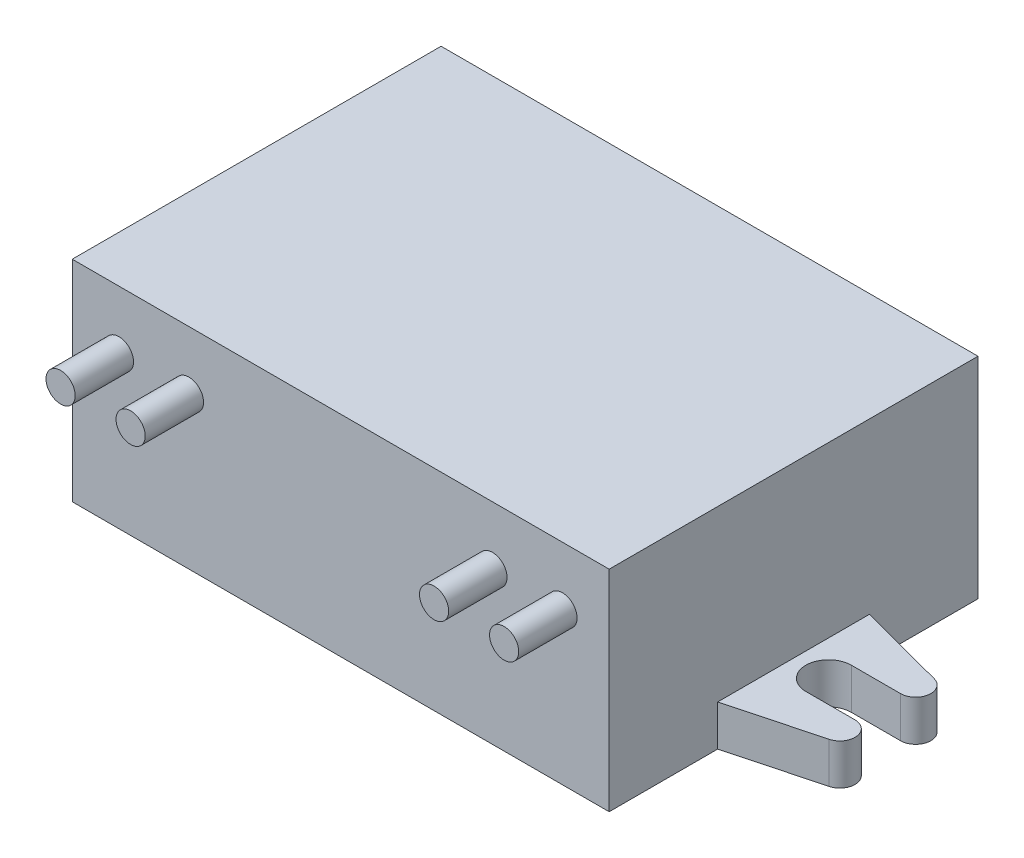
ISO-10303-21;
HEADER;
FILE_DESCRIPTION(('STEP AP214'),'2;1');
FILE_NAME('part.step','',(''),(''),'','','');
FILE_SCHEMA(('AUTOMOTIVE_DESIGN { 1 0 10303 214 1 1 1 1 }'));
ENDSEC;
DATA;
#1=APPLICATION_CONTEXT('core data for automotive mechanical design processes');
#2=APPLICATION_PROTOCOL_DEFINITION('international standard','automotive_design',2000,#1);
#3=PRODUCT_CONTEXT('',#1,'mechanical');
#4=PRODUCT('Part','Part','',(#3));
#5=PRODUCT_RELATED_PRODUCT_CATEGORY('part','',(#4));
#6=PRODUCT_DEFINITION_FORMATION('','',#4);
#7=PRODUCT_DEFINITION_CONTEXT('part definition',#1,'design');
#8=PRODUCT_DEFINITION('design','',#6,#7);
#9=PRODUCT_DEFINITION_SHAPE('','',#8);
#10=(LENGTH_UNIT() NAMED_UNIT(*) SI_UNIT(.MILLI.,.METRE.));
#11=(NAMED_UNIT(*) PLANE_ANGLE_UNIT() SI_UNIT($,.RADIAN.));
#12=(NAMED_UNIT(*) SI_UNIT($,.STERADIAN.) SOLID_ANGLE_UNIT());
#13=UNCERTAINTY_MEASURE_WITH_UNIT(LENGTH_MEASURE(1.E-05),#10,'distance_accuracy_value','');
#14=(GEOMETRIC_REPRESENTATION_CONTEXT(3) GLOBAL_UNCERTAINTY_ASSIGNED_CONTEXT((#13)) GLOBAL_UNIT_ASSIGNED_CONTEXT((#10,
#11,#12)) REPRESENTATION_CONTEXT('',''));
#15=CARTESIAN_POINT('',(0.,0.,0.));
#16=DIRECTION('',(0.,0.,1.));
#17=DIRECTION('',(1.,0.,0.));
#18=AXIS2_PLACEMENT_3D('',#15,#16,#17);
#19=CARTESIAN_POINT('',(-23.,18.,0.));
#20=DIRECTION('',(1.,0.,0.));
#21=DIRECTION('',(0.,0.,-1.));
#22=AXIS2_PLACEMENT_3D('',#19,#20,#21);
#23=PLANE('',#22);
#24=DIRECTION('',(0.,-1.,0.));
#25=VECTOR('',#24,1.);
#26=CARTESIAN_POINT('',(-23.,3.5,-6.49999999999999));
#27=LINE('',#26,#25);
#28=CARTESIAN_POINT('',(-23.,3.5,-6.49999999999999));
#29=VERTEX_POINT('',#28);
#30=CARTESIAN_POINT('',(-23.,0.,-6.49999999999999));
#31=VERTEX_POINT('',#30);
#32=EDGE_CURVE('E299',#29,#31,#27,.T.);
#33=ORIENTED_EDGE('',*,*,#32,.F.);
#34=DIRECTION('',(0.,0.,1.));
#35=VECTOR('',#34,1.);
#36=CARTESIAN_POINT('',(-23.,3.5,0.));
#37=LINE('',#36,#35);
#38=CARTESIAN_POINT('',(-23.,3.5,6.50000000000001));
#39=VERTEX_POINT('',#38);
#40=EDGE_CURVE('E295',#29,#39,#37,.T.);
#41=ORIENTED_EDGE('',*,*,#40,.T.);
#42=DIRECTION('',(0.,-1.,0.));
#43=VECTOR('',#42,1.);
#44=CARTESIAN_POINT('',(-23.,3.5,6.50000000000001));
#45=LINE('',#44,#43);
#46=CARTESIAN_POINT('',(-23.,0.,6.50000000000001));
#47=VERTEX_POINT('',#46);
#48=EDGE_CURVE('E322',#39,#47,#45,.T.);
#49=ORIENTED_EDGE('',*,*,#48,.T.);
#50=DIRECTION('',(0.,0.,1.));
#51=VECTOR('',#50,1.);
#52=CARTESIAN_POINT('',(-23.,0.,0.));
#53=LINE('',#52,#51);
#54=CARTESIAN_POINT('',(-23.,0.,15.8));
#55=VERTEX_POINT('',#54);
#56=EDGE_CURVE('E373',#47,#55,#53,.T.);
#57=ORIENTED_EDGE('',*,*,#56,.T.);
#58=DIRECTION('',(0.,-1.,0.));
#59=VECTOR('',#58,1.);
#60=CARTESIAN_POINT('',(-23.,18.,15.8));
#61=LINE('',#60,#59);
#62=CARTESIAN_POINT('',(-23.,18.,15.8));
#63=VERTEX_POINT('',#62);
#64=EDGE_CURVE('E384',#63,#55,#61,.T.);
#65=ORIENTED_EDGE('',*,*,#64,.F.);
#66=DIRECTION('',(0.,0.,1.));
#67=VECTOR('',#66,1.);
#68=CARTESIAN_POINT('',(-23.,18.,0.));
#69=LINE('',#68,#67);
#70=CARTESIAN_POINT('',(-23.,18.,-15.8));
#71=VERTEX_POINT('',#70);
#72=EDGE_CURVE('E358',#71,#63,#69,.T.);
#73=ORIENTED_EDGE('',*,*,#72,.F.);
#74=DIRECTION('',(0.,-1.,0.));
#75=VECTOR('',#74,1.);
#76=CARTESIAN_POINT('',(-23.,18.,-15.8));
#77=LINE('',#76,#75);
#78=CARTESIAN_POINT('',(-23.,0.,-15.8));
#79=VERTEX_POINT('',#78);
#80=EDGE_CURVE('E388',#71,#79,#77,.T.);
#81=ORIENTED_EDGE('',*,*,#80,.T.);
#82=EDGE_CURVE('E374',#79,#31,#53,.T.);
#83=ORIENTED_EDGE('',*,*,#82,.T.);
#84=EDGE_LOOP('',(#33,#41,#49,#57,#65,#73,#81,#83));
#85=FACE_BOUND('',#84,.T.);
#86=ADVANCED_FACE('F39',(#85),#23,.F.);
#87=CARTESIAN_POINT('',(23.,18.,0.));
#88=DIRECTION('',(1.,0.,0.));
#89=DIRECTION('',(0.,0.,-1.));
#90=AXIS2_PLACEMENT_3D('',#87,#88,#89);
#91=PLANE('',#90);
#92=DIRECTION('',(0.,-1.,0.));
#93=VECTOR('',#92,1.);
#94=CARTESIAN_POINT('',(23.,3.5,6.50000000000001));
#95=LINE('',#94,#93);
#96=CARTESIAN_POINT('',(23.,3.5,6.50000000000001));
#97=VERTEX_POINT('',#96);
#98=CARTESIAN_POINT('',(23.,0.,6.50000000000001));
#99=VERTEX_POINT('',#98);
#100=EDGE_CURVE('E256',#97,#99,#95,.T.);
#101=ORIENTED_EDGE('',*,*,#100,.F.);
#102=DIRECTION('',(0.,0.,1.));
#103=VECTOR('',#102,1.);
#104=CARTESIAN_POINT('',(23.,3.5,0.));
#105=LINE('',#104,#103);
#106=CARTESIAN_POINT('',(23.,3.5,-6.49999999999999));
#107=VERTEX_POINT('',#106);
#108=EDGE_CURVE('E225',#107,#97,#105,.T.);
#109=ORIENTED_EDGE('',*,*,#108,.F.);
#110=DIRECTION('',(0.,-1.,0.));
#111=VECTOR('',#110,1.);
#112=CARTESIAN_POINT('',(23.,3.5,-6.49999999999999));
#113=LINE('',#112,#111);
#114=CARTESIAN_POINT('',(23.,0.,-6.49999999999999));
#115=VERTEX_POINT('',#114);
#116=EDGE_CURVE('E259',#107,#115,#113,.T.);
#117=ORIENTED_EDGE('',*,*,#116,.T.);
#118=DIRECTION('',(0.,0.,1.));
#119=VECTOR('',#118,1.);
#120=CARTESIAN_POINT('',(23.,0.,0.));
#121=LINE('',#120,#119);
#122=CARTESIAN_POINT('',(23.,0.,-15.8));
#123=VERTEX_POINT('',#122);
#124=EDGE_CURVE('E365',#123,#115,#121,.T.);
#125=ORIENTED_EDGE('',*,*,#124,.F.);
#126=DIRECTION('',(0.,-1.,0.));
#127=VECTOR('',#126,1.);
#128=CARTESIAN_POINT('',(23.,18.,-15.8));
#129=LINE('',#128,#127);
#130=CARTESIAN_POINT('',(23.,18.,-15.8));
#131=VERTEX_POINT('',#130);
#132=EDGE_CURVE('E391',#131,#123,#129,.T.);
#133=ORIENTED_EDGE('',*,*,#132,.F.);
#134=DIRECTION('',(0.,0.,1.));
#135=VECTOR('',#134,1.);
#136=CARTESIAN_POINT('',(23.,18.,0.));
#137=LINE('',#136,#135);
#138=CARTESIAN_POINT('',(23.,18.,15.8));
#139=VERTEX_POINT('',#138);
#140=EDGE_CURVE('E349',#131,#139,#137,.T.);
#141=ORIENTED_EDGE('',*,*,#140,.T.);
#142=DIRECTION('',(0.,-1.,0.));
#143=VECTOR('',#142,1.);
#144=CARTESIAN_POINT('',(23.,18.,15.8));
#145=LINE('',#144,#143);
#146=CARTESIAN_POINT('',(23.,0.,15.8));
#147=VERTEX_POINT('',#146);
#148=EDGE_CURVE('E364',#139,#147,#145,.T.);
#149=ORIENTED_EDGE('',*,*,#148,.T.);
#150=EDGE_CURVE('E348',#99,#147,#121,.T.);
#151=ORIENTED_EDGE('',*,*,#150,.F.);
#152=EDGE_LOOP('',(#101,#109,#117,#125,#133,#141,#149,#151));
#153=FACE_BOUND('',#152,.T.);
#154=ADVANCED_FACE('F41',(#153),#91,.T.);
#155=CARTESIAN_POINT('',(0.,18.,-15.8));
#156=DIRECTION('',(0.,0.,-1.));
#157=DIRECTION('',(-1.,0.,0.));
#158=AXIS2_PLACEMENT_3D('',#155,#156,#157);
#159=PLANE('',#158);
#160=DIRECTION('',(1.,0.,0.));
#161=VECTOR('',#160,1.);
#162=CARTESIAN_POINT('',(0.,0.,-15.8));
#163=LINE('',#162,#161);
#164=EDGE_CURVE('E369',#79,#123,#163,.T.);
#165=ORIENTED_EDGE('',*,*,#164,.F.);
#166=ORIENTED_EDGE('',*,*,#80,.F.);
#167=DIRECTION('',(1.,0.,0.));
#168=VECTOR('',#167,1.);
#169=CARTESIAN_POINT('',(0.,18.,-15.8));
#170=LINE('',#169,#168);
#171=EDGE_CURVE('E353',#71,#131,#170,.T.);
#172=ORIENTED_EDGE('',*,*,#171,.T.);
#173=ORIENTED_EDGE('',*,*,#132,.T.);
#174=EDGE_LOOP('',(#165,#166,#172,#173));
#175=FACE_BOUND('',#174,.T.);
#176=ADVANCED_FACE('F411',(#175),#159,.T.);
#177=CARTESIAN_POINT('',(0.,18.,15.8));
#178=DIRECTION('',(0.,0.,-1.));
#179=DIRECTION('',(-1.,0.,0.));
#180=AXIS2_PLACEMENT_3D('',#177,#178,#179);
#181=PLANE('',#180);
#182=CARTESIAN_POINT('',(-13.,13.,15.8));
#183=DIRECTION('',(0.,0.,-1.));
#184=DIRECTION('',(-1.,0.,0.));
#185=AXIS2_PLACEMENT_3D('',#182,#183,#184);
#186=CIRCLE('',#185,1.25);
#187=CARTESIAN_POINT('',(-14.25,13.,15.8));
#188=VERTEX_POINT('',#187);
#189=EDGE_CURVE('E11',#188,#188,#186,.F.);
#190=ORIENTED_EDGE('',*,*,#189,.F.);
#191=EDGE_LOOP('',(#190));
#192=FACE_BOUND('',#191,.T.);
#193=CARTESIAN_POINT('',(-19.,13.,15.8));
#194=DIRECTION('',(0.,0.,-1.));
#195=DIRECTION('',(-1.,0.,0.));
#196=AXIS2_PLACEMENT_3D('',#193,#194,#195);
#197=CIRCLE('',#196,1.25);
#198=CARTESIAN_POINT('',(-20.25,13.,15.8));
#199=VERTEX_POINT('',#198);
#200=EDGE_CURVE('E48',#199,#199,#197,.F.);
#201=ORIENTED_EDGE('',*,*,#200,.F.);
#202=EDGE_LOOP('',(#201));
#203=FACE_BOUND('',#202,.T.);
#204=CARTESIAN_POINT('',(13.,13.,15.8));
#205=DIRECTION('',(0.,0.,-1.));
#206=DIRECTION('',(-1.,0.,0.));
#207=AXIS2_PLACEMENT_3D('',#204,#205,#206);
#208=CIRCLE('',#207,1.25);
#209=CARTESIAN_POINT('',(11.75,13.,15.8));
#210=VERTEX_POINT('',#209);
#211=EDGE_CURVE('E398',#210,#210,#208,.F.);
#212=ORIENTED_EDGE('',*,*,#211,.F.);
#213=EDGE_LOOP('',(#212));
#214=FACE_BOUND('',#213,.T.);
#215=CARTESIAN_POINT('',(19.,13.,15.8));
#216=DIRECTION('',(0.,0.,-1.));
#217=DIRECTION('',(-1.,0.,0.));
#218=AXIS2_PLACEMENT_3D('',#215,#216,#217);
#219=CIRCLE('',#218,1.25);
#220=CARTESIAN_POINT('',(17.75,13.,15.8));
#221=VERTEX_POINT('',#220);
#222=EDGE_CURVE('E394',#221,#221,#219,.F.);
#223=ORIENTED_EDGE('',*,*,#222,.F.);
#224=EDGE_LOOP('',(#223));
#225=FACE_BOUND('',#224,.T.);
#226=DIRECTION('',(1.,0.,0.));
#227=VECTOR('',#226,1.);
#228=CARTESIAN_POINT('',(0.,0.,15.8));
#229=LINE('',#228,#227);
#230=EDGE_CURVE('E354',#55,#147,#229,.T.);
#231=ORIENTED_EDGE('',*,*,#230,.T.);
#232=ORIENTED_EDGE('',*,*,#148,.F.);
#233=DIRECTION('',(1.,0.,0.));
#234=VECTOR('',#233,1.);
#235=CARTESIAN_POINT('',(0.,18.,15.8));
#236=LINE('',#235,#234);
#237=EDGE_CURVE('E361',#63,#139,#236,.T.);
#238=ORIENTED_EDGE('',*,*,#237,.F.);
#239=ORIENTED_EDGE('',*,*,#64,.T.);
#240=EDGE_LOOP('',(#231,#232,#238,#239));
#241=FACE_BOUND('',#240,.T.);
#242=ADVANCED_FACE('F407',(#192,#203,#214,#225,#241),#181,.F.);
#243=CARTESIAN_POINT('',(0.,18.,0.));
#244=DIRECTION('',(0.,1.,0.));
#245=DIRECTION('',(0.,0.,1.));
#246=AXIS2_PLACEMENT_3D('',#243,#244,#245);
#247=PLANE('',#246);
#248=ORIENTED_EDGE('',*,*,#140,.F.);
#249=ORIENTED_EDGE('',*,*,#171,.F.);
#250=ORIENTED_EDGE('',*,*,#72,.T.);
#251=ORIENTED_EDGE('',*,*,#237,.T.);
#252=EDGE_LOOP('',(#248,#249,#250,#251));
#253=FACE_BOUND('',#252,.T.);
#254=ADVANCED_FACE('F410',(#253),#247,.T.);
#255=CARTESIAN_POINT('',(0.,0.,0.));
#256=DIRECTION('',(0.,1.,0.));
#257=DIRECTION('',(0.,0.,1.));
#258=AXIS2_PLACEMENT_3D('',#255,#256,#257);
#259=PLANE('',#258);
#260=ORIENTED_EDGE('',*,*,#124,.T.);
#261=DIRECTION('',(0.966628418373112,0.,0.256182553647777));
#262=VECTOR('',#261,1.);
#263=CARTESIAN_POINT('',(3.11909520645809,0.,-11.768974987731));
#264=LINE('',#263,#262);
#265=CARTESIAN_POINT('',(30.546403177026,0.,-4.50000000000001));
#266=VERTEX_POINT('',#265);
#267=EDGE_CURVE('E55',#115,#266,#264,.T.);
#268=ORIENTED_EDGE('',*,*,#267,.T.);
#269=CARTESIAN_POINT('',(30.2142278124788,0.,-3.24663538682589));
#270=DIRECTION('',(0.,1.,0.));
#271=DIRECTION('',(0.,0.,1.));
#272=AXIS2_PLACEMENT_3D('',#269,#270,#271);
#273=CIRCLE('',#272,1.29663538682589);
#274=CARTESIAN_POINT('',(30.2142278124788,0.,-1.95000000000001));
#275=VERTEX_POINT('',#274);
#276=EDGE_CURVE('E245',#266,#275,#273,.F.);
#277=ORIENTED_EDGE('',*,*,#276,.T.);
#278=DIRECTION('',(-1.,0.,0.));
#279=VECTOR('',#278,1.);
#280=CARTESIAN_POINT('',(0.,0.,-1.95));
#281=LINE('',#280,#279);
#282=CARTESIAN_POINT('',(26.,0.,-1.95000000000001));
#283=VERTEX_POINT('',#282);
#284=EDGE_CURVE('E241',#275,#283,#281,.T.);
#285=ORIENTED_EDGE('',*,*,#284,.T.);
#286=CARTESIAN_POINT('',(26.,0.,0.));
#287=DIRECTION('',(0.,1.,0.));
#288=DIRECTION('',(0.,0.,1.));
#289=AXIS2_PLACEMENT_3D('',#286,#287,#288);
#290=CIRCLE('',#289,1.95);
#291=CARTESIAN_POINT('',(26.,0.,1.94999999999999));
#292=VERTEX_POINT('',#291);
#293=EDGE_CURVE('E237',#283,#292,#290,.T.);
#294=ORIENTED_EDGE('',*,*,#293,.T.);
#295=DIRECTION('',(1.,0.,0.));
#296=VECTOR('',#295,1.);
#297=CARTESIAN_POINT('',(0.,0.,1.95));
#298=LINE('',#297,#296);
#299=CARTESIAN_POINT('',(30.2142278124788,0.,1.94999999999999));
#300=VERTEX_POINT('',#299);
#301=EDGE_CURVE('E233',#292,#300,#298,.T.);
#302=ORIENTED_EDGE('',*,*,#301,.T.);
#303=CARTESIAN_POINT('',(30.2142278124788,0.,3.24663538682588));
#304=DIRECTION('',(0.,1.,0.));
#305=DIRECTION('',(0.,0.,1.));
#306=AXIS2_PLACEMENT_3D('',#303,#304,#305);
#307=CIRCLE('',#306,1.29663538682589);
#308=CARTESIAN_POINT('',(30.546403177026,0.,4.49999999999999));
#309=VERTEX_POINT('',#308);
#310=EDGE_CURVE('E185',#300,#309,#307,.F.);
#311=ORIENTED_EDGE('',*,*,#310,.T.);
#312=DIRECTION('',(-0.966628418373111,0.,0.256182553647781));
#313=VECTOR('',#312,1.);
#314=CARTESIAN_POINT('',(3.11909520645817,0.,11.7689749877311));
#315=LINE('',#314,#313);
#316=EDGE_CURVE('E203',#309,#99,#315,.T.);
#317=ORIENTED_EDGE('',*,*,#316,.T.);
#318=ORIENTED_EDGE('',*,*,#150,.T.);
#319=ORIENTED_EDGE('',*,*,#230,.F.);
#320=ORIENTED_EDGE('',*,*,#56,.F.);
#321=DIRECTION('',(0.966628418373111,0.,0.256182553647781));
#322=VECTOR('',#321,1.);
#323=CARTESIAN_POINT('',(-3.11909520645817,0.,11.7689749877311));
#324=LINE('',#323,#322);
#325=CARTESIAN_POINT('',(-30.546403177026,0.,4.5));
#326=VERTEX_POINT('',#325);
#327=EDGE_CURVE('E63',#326,#47,#324,.T.);
#328=ORIENTED_EDGE('',*,*,#327,.F.);
#329=CARTESIAN_POINT('',(-30.2142278124788,0.,3.24663538682589));
#330=DIRECTION('',(0.,1.,0.));
#331=DIRECTION('',(0.,0.,1.));
#332=AXIS2_PLACEMENT_3D('',#329,#330,#331);
#333=CIRCLE('',#332,1.29663538682589);
#334=CARTESIAN_POINT('',(-30.2142278124788,0.,1.95));
#335=VERTEX_POINT('',#334);
#336=EDGE_CURVE('E315',#335,#326,#333,.T.);
#337=ORIENTED_EDGE('',*,*,#336,.F.);
#338=DIRECTION('',(-1.,0.,0.));
#339=VECTOR('',#338,1.);
#340=CARTESIAN_POINT('',(0.,0.,1.95));
#341=LINE('',#340,#339);
#342=CARTESIAN_POINT('',(-26.,0.,1.95));
#343=VERTEX_POINT('',#342);
#344=EDGE_CURVE('E312',#343,#335,#341,.T.);
#345=ORIENTED_EDGE('',*,*,#344,.F.);
#346=CARTESIAN_POINT('',(-26.,0.,0.));
#347=DIRECTION('',(0.,1.,0.));
#348=DIRECTION('',(0.,0.,1.));
#349=AXIS2_PLACEMENT_3D('',#346,#347,#348);
#350=CIRCLE('',#349,1.95);
#351=CARTESIAN_POINT('',(-26.,0.,-1.95));
#352=VERTEX_POINT('',#351);
#353=EDGE_CURVE('E309',#352,#343,#350,.F.);
#354=ORIENTED_EDGE('',*,*,#353,.F.);
#355=DIRECTION('',(1.,0.,0.));
#356=VECTOR('',#355,1.);
#357=CARTESIAN_POINT('',(0.,0.,-1.95));
#358=LINE('',#357,#356);
#359=CARTESIAN_POINT('',(-30.2142278124788,0.,-1.95));
#360=VERTEX_POINT('',#359);
#361=EDGE_CURVE('E306',#360,#352,#358,.T.);
#362=ORIENTED_EDGE('',*,*,#361,.F.);
#363=CARTESIAN_POINT('',(-30.2142278124788,0.,-3.24663538682589));
#364=DIRECTION('',(0.,1.,0.));
#365=DIRECTION('',(0.,0.,1.));
#366=AXIS2_PLACEMENT_3D('',#363,#364,#365);
#367=CIRCLE('',#366,1.29663538682589);
#368=CARTESIAN_POINT('',(-30.546403177026,0.,-4.5));
#369=VERTEX_POINT('',#368);
#370=EDGE_CURVE('E303',#369,#360,#367,.T.);
#371=ORIENTED_EDGE('',*,*,#370,.F.);
#372=DIRECTION('',(-0.966628418373112,0.,0.256182553647778));
#373=VECTOR('',#372,1.);
#374=CARTESIAN_POINT('',(-3.1190952064581,0.,-11.768974987731));
#375=LINE('',#374,#373);
#376=EDGE_CURVE('E191',#31,#369,#375,.T.);
#377=ORIENTED_EDGE('',*,*,#376,.F.);
#378=ORIENTED_EDGE('',*,*,#82,.F.);
#379=ORIENTED_EDGE('',*,*,#164,.T.);
#380=EDGE_LOOP('',(#260,#268,#277,#285,#294,#302,#311,#317,#318,#319,#320,#328,#337,#345,#354,
#362,#371,#377,#378,#379));
#381=FACE_BOUND('',#380,.T.);
#382=ADVANCED_FACE('F424',(#381),#259,.F.);
#383=CARTESIAN_POINT('',(-3.1190952064581,3.5,-11.768974987731));
#384=DIRECTION('',(0.256182553647778,0.,0.966628418373112));
#385=DIRECTION('',(0.966628418373112,0.,-0.256182553647778));
#386=AXIS2_PLACEMENT_3D('',#383,#384,#385);
#387=PLANE('',#386);
#388=ORIENTED_EDGE('',*,*,#376,.T.);
#389=DIRECTION('',(0.,-1.,0.));
#390=VECTOR('',#389,1.);
#391=CARTESIAN_POINT('',(-30.546403177026,3.5,-4.5));
#392=LINE('',#391,#390);
#393=CARTESIAN_POINT('',(-30.546403177026,3.5,-4.5));
#394=VERTEX_POINT('',#393);
#395=EDGE_CURVE('E344',#394,#369,#392,.T.);
#396=ORIENTED_EDGE('',*,*,#395,.F.);
#397=DIRECTION('',(-0.966628418373112,0.,0.256182553647778));
#398=VECTOR('',#397,1.);
#399=CARTESIAN_POINT('',(-3.1190952064581,3.5,-11.768974987731));
#400=LINE('',#399,#398);
#401=EDGE_CURVE('E273',#29,#394,#400,.T.);
#402=ORIENTED_EDGE('',*,*,#401,.F.);
#403=ORIENTED_EDGE('',*,*,#32,.T.);
#404=EDGE_LOOP('',(#388,#396,#402,#403));
#405=FACE_BOUND('',#404,.T.);
#406=ADVANCED_FACE('F472',(#405),#387,.F.);
#407=CARTESIAN_POINT('',(-30.2142278124788,3.5,-3.24663538682589));
#408=DIRECTION('',(0.,-1.,0.));
#409=DIRECTION('',(0.,0.,-1.));
#410=AXIS2_PLACEMENT_3D('',#407,#408,#409);
#411=CYLINDRICAL_SURFACE('',#410,1.29663538682589);
#412=ORIENTED_EDGE('',*,*,#370,.T.);
#413=DIRECTION('',(0.,-1.,0.));
#414=VECTOR('',#413,1.);
#415=CARTESIAN_POINT('',(-30.2142278124788,3.5,-1.95));
#416=LINE('',#415,#414);
#417=CARTESIAN_POINT('',(-30.2142278124788,3.5,-1.95));
#418=VERTEX_POINT('',#417);
#419=EDGE_CURVE('E340',#418,#360,#416,.T.);
#420=ORIENTED_EDGE('',*,*,#419,.F.);
#421=CARTESIAN_POINT('',(-30.2142278124788,3.5,-3.24663538682589));
#422=DIRECTION('',(0.,1.,0.));
#423=DIRECTION('',(0.,0.,1.));
#424=AXIS2_PLACEMENT_3D('',#421,#422,#423);
#425=CIRCLE('',#424,1.29663538682589);
#426=EDGE_CURVE('E277',#394,#418,#425,.T.);
#427=ORIENTED_EDGE('',*,*,#426,.F.);
#428=ORIENTED_EDGE('',*,*,#395,.T.);
#429=EDGE_LOOP('',(#412,#420,#427,#428));
#430=FACE_BOUND('',#429,.T.);
#431=ADVANCED_FACE('F470',(#430),#411,.T.);
#432=CARTESIAN_POINT('',(0.,3.5,-1.95));
#433=DIRECTION('',(0.,0.,-1.));
#434=DIRECTION('',(-1.,0.,0.));
#435=AXIS2_PLACEMENT_3D('',#432,#433,#434);
#436=PLANE('',#435);
#437=ORIENTED_EDGE('',*,*,#361,.T.);
#438=DIRECTION('',(0.,-1.,0.));
#439=VECTOR('',#438,1.);
#440=CARTESIAN_POINT('',(-26.,3.5,-1.95));
#441=LINE('',#440,#439);
#442=CARTESIAN_POINT('',(-26.,3.5,-1.95));
#443=VERTEX_POINT('',#442);
#444=EDGE_CURVE('E336',#443,#352,#441,.T.);
#445=ORIENTED_EDGE('',*,*,#444,.F.);
#446=DIRECTION('',(1.,0.,0.));
#447=VECTOR('',#446,1.);
#448=CARTESIAN_POINT('',(0.,3.5,-1.95));
#449=LINE('',#448,#447);
#450=EDGE_CURVE('E280',#418,#443,#449,.T.);
#451=ORIENTED_EDGE('',*,*,#450,.F.);
#452=ORIENTED_EDGE('',*,*,#419,.T.);
#453=EDGE_LOOP('',(#437,#445,#451,#452));
#454=FACE_BOUND('',#453,.T.);
#455=ADVANCED_FACE('F465',(#454),#436,.F.);
#456=CARTESIAN_POINT('',(-26.,3.5,0.));
#457=DIRECTION('',(0.,-1.,0.));
#458=DIRECTION('',(0.,0.,-1.));
#459=AXIS2_PLACEMENT_3D('',#456,#457,#458);
#460=CYLINDRICAL_SURFACE('',#459,1.95);
#461=ORIENTED_EDGE('',*,*,#353,.T.);
#462=DIRECTION('',(0.,-1.,0.));
#463=VECTOR('',#462,1.);
#464=CARTESIAN_POINT('',(-26.,3.5,1.95));
#465=LINE('',#464,#463);
#466=CARTESIAN_POINT('',(-26.,3.5,1.95));
#467=VERTEX_POINT('',#466);
#468=EDGE_CURVE('E332',#467,#343,#465,.T.);
#469=ORIENTED_EDGE('',*,*,#468,.F.);
#470=CARTESIAN_POINT('',(-26.,3.5,0.));
#471=DIRECTION('',(0.,1.,0.));
#472=DIRECTION('',(0.,0.,1.));
#473=AXIS2_PLACEMENT_3D('',#470,#471,#472);
#474=CIRCLE('',#473,1.95);
#475=EDGE_CURVE('E283',#443,#467,#474,.F.);
#476=ORIENTED_EDGE('',*,*,#475,.F.);
#477=ORIENTED_EDGE('',*,*,#444,.T.);
#478=EDGE_LOOP('',(#461,#469,#476,#477));
#479=FACE_BOUND('',#478,.T.);
#480=ADVANCED_FACE('F461',(#479),#460,.F.);
#481=CARTESIAN_POINT('',(0.,3.5,1.95));
#482=DIRECTION('',(0.,0.,1.));
#483=DIRECTION('',(1.,0.,0.));
#484=AXIS2_PLACEMENT_3D('',#481,#482,#483);
#485=PLANE('',#484);
#486=ORIENTED_EDGE('',*,*,#344,.T.);
#487=DIRECTION('',(0.,-1.,0.));
#488=VECTOR('',#487,1.);
#489=CARTESIAN_POINT('',(-30.2142278124788,3.5,1.95));
#490=LINE('',#489,#488);
#491=CARTESIAN_POINT('',(-30.2142278124788,3.5,1.95));
#492=VERTEX_POINT('',#491);
#493=EDGE_CURVE('E328',#492,#335,#490,.T.);
#494=ORIENTED_EDGE('',*,*,#493,.F.);
#495=DIRECTION('',(-1.,0.,0.));
#496=VECTOR('',#495,1.);
#497=CARTESIAN_POINT('',(0.,3.5,1.95));
#498=LINE('',#497,#496);
#499=EDGE_CURVE('E286',#467,#492,#498,.T.);
#500=ORIENTED_EDGE('',*,*,#499,.F.);
#501=ORIENTED_EDGE('',*,*,#468,.T.);
#502=EDGE_LOOP('',(#486,#494,#500,#501));
#503=FACE_BOUND('',#502,.T.);
#504=ADVANCED_FACE('F457',(#503),#485,.F.);
#505=CARTESIAN_POINT('',(-30.2142278124788,3.5,3.24663538682589));
#506=DIRECTION('',(0.,-1.,0.));
#507=DIRECTION('',(0.,0.,-1.));
#508=AXIS2_PLACEMENT_3D('',#505,#506,#507);
#509=CYLINDRICAL_SURFACE('',#508,1.29663538682589);
#510=ORIENTED_EDGE('',*,*,#336,.T.);
#511=DIRECTION('',(0.,-1.,0.));
#512=VECTOR('',#511,1.);
#513=CARTESIAN_POINT('',(-30.546403177026,3.5,4.5));
#514=LINE('',#513,#512);
#515=CARTESIAN_POINT('',(-30.546403177026,3.5,4.5));
#516=VERTEX_POINT('',#515);
#517=EDGE_CURVE('E325',#516,#326,#514,.T.);
#518=ORIENTED_EDGE('',*,*,#517,.F.);
#519=CARTESIAN_POINT('',(-30.2142278124788,3.5,3.24663538682589));
#520=DIRECTION('',(0.,1.,0.));
#521=DIRECTION('',(0.,0.,1.));
#522=AXIS2_PLACEMENT_3D('',#519,#520,#521);
#523=CIRCLE('',#522,1.29663538682589);
#524=EDGE_CURVE('E289',#492,#516,#523,.T.);
#525=ORIENTED_EDGE('',*,*,#524,.F.);
#526=ORIENTED_EDGE('',*,*,#493,.T.);
#527=EDGE_LOOP('',(#510,#518,#525,#526));
#528=FACE_BOUND('',#527,.T.);
#529=ADVANCED_FACE('F451',(#528),#509,.T.);
#530=CARTESIAN_POINT('',(-3.11909520645817,3.5,11.7689749877311));
#531=DIRECTION('',(0.256182553647781,0.,-0.966628418373111));
#532=DIRECTION('',(-0.966628418373111,0.,-0.256182553647781));
#533=AXIS2_PLACEMENT_3D('',#530,#531,#532);
#534=PLANE('',#533);
#535=ORIENTED_EDGE('',*,*,#327,.T.);
#536=ORIENTED_EDGE('',*,*,#48,.F.);
#537=DIRECTION('',(0.966628418373111,0.,0.256182553647781));
#538=VECTOR('',#537,1.);
#539=CARTESIAN_POINT('',(-3.11909520645817,3.5,11.7689749877311));
#540=LINE('',#539,#538);
#541=EDGE_CURVE('E292',#516,#39,#540,.T.);
#542=ORIENTED_EDGE('',*,*,#541,.F.);
#543=ORIENTED_EDGE('',*,*,#517,.T.);
#544=EDGE_LOOP('',(#535,#536,#542,#543));
#545=FACE_BOUND('',#544,.T.);
#546=ADVANCED_FACE('F443',(#545),#534,.F.);
#547=CARTESIAN_POINT('',(0.,3.5,0.));
#548=DIRECTION('',(0.,1.,0.));
#549=DIRECTION('',(0.,0.,1.));
#550=AXIS2_PLACEMENT_3D('',#547,#548,#549);
#551=PLANE('',#550);
#552=ORIENTED_EDGE('',*,*,#401,.T.);
#553=ORIENTED_EDGE('',*,*,#426,.T.);
#554=ORIENTED_EDGE('',*,*,#450,.T.);
#555=ORIENTED_EDGE('',*,*,#475,.T.);
#556=ORIENTED_EDGE('',*,*,#499,.T.);
#557=ORIENTED_EDGE('',*,*,#524,.T.);
#558=ORIENTED_EDGE('',*,*,#541,.T.);
#559=ORIENTED_EDGE('',*,*,#40,.F.);
#560=EDGE_LOOP('',(#552,#553,#554,#555,#556,#557,#558,#559));
#561=FACE_BOUND('',#560,.T.);
#562=ADVANCED_FACE('F446',(#561),#551,.T.);
#563=CARTESIAN_POINT('',(30.2142278124788,3.5,3.24663538682588));
#564=DIRECTION('',(0.,-1.,0.));
#565=DIRECTION('',(0.,0.,-1.));
#566=AXIS2_PLACEMENT_3D('',#563,#564,#565);
#567=CYLINDRICAL_SURFACE('',#566,1.29663538682589);
#568=ORIENTED_EDGE('',*,*,#310,.F.);
#569=DIRECTION('',(0.,-1.,0.));
#570=VECTOR('',#569,1.);
#571=CARTESIAN_POINT('',(30.2142278124788,3.5,1.94999999999999));
#572=LINE('',#571,#570);
#573=CARTESIAN_POINT('',(30.2142278124788,3.5,1.94999999999999));
#574=VERTEX_POINT('',#573);
#575=EDGE_CURVE('E179',#574,#300,#572,.T.);
#576=ORIENTED_EDGE('',*,*,#575,.F.);
#577=CARTESIAN_POINT('',(30.2142278124788,3.5,3.24663538682588));
#578=DIRECTION('',(0.,1.,0.));
#579=DIRECTION('',(0.,0.,1.));
#580=AXIS2_PLACEMENT_3D('',#577,#578,#579);
#581=CIRCLE('',#580,1.29663538682589);
#582=CARTESIAN_POINT('',(30.546403177026,3.5,4.49999999999999));
#583=VERTEX_POINT('',#582);
#584=EDGE_CURVE('E182',#574,#583,#581,.F.);
#585=ORIENTED_EDGE('',*,*,#584,.T.);
#586=DIRECTION('',(0.,-1.,0.));
#587=VECTOR('',#586,1.);
#588=CARTESIAN_POINT('',(30.546403177026,3.5,4.49999999999999));
#589=LINE('',#588,#587);
#590=EDGE_CURVE('E230',#583,#309,#589,.T.);
#591=ORIENTED_EDGE('',*,*,#590,.T.);
#592=EDGE_LOOP('',(#568,#576,#585,#591));
#593=FACE_BOUND('',#592,.T.);
#594=ADVANCED_FACE('F181',(#593),#567,.T.);
#595=CARTESIAN_POINT('',(0.,3.5,1.95));
#596=DIRECTION('',(0.,0.,-1.));
#597=DIRECTION('',(-1.,0.,0.));
#598=AXIS2_PLACEMENT_3D('',#595,#596,#597);
#599=PLANE('',#598);
#600=ORIENTED_EDGE('',*,*,#301,.F.);
#601=DIRECTION('',(0.,-1.,0.));
#602=VECTOR('',#601,1.);
#603=CARTESIAN_POINT('',(26.,3.5,1.94999999999999));
#604=LINE('',#603,#602);
#605=CARTESIAN_POINT('',(26.,3.5,1.94999999999999));
#606=VERTEX_POINT('',#605);
#607=EDGE_CURVE('E192',#606,#292,#604,.T.);
#608=ORIENTED_EDGE('',*,*,#607,.F.);
#609=DIRECTION('',(1.,0.,0.));
#610=VECTOR('',#609,1.);
#611=CARTESIAN_POINT('',(0.,3.5,1.95));
#612=LINE('',#611,#610);
#613=EDGE_CURVE('E198',#606,#574,#612,.T.);
#614=ORIENTED_EDGE('',*,*,#613,.T.);
#615=ORIENTED_EDGE('',*,*,#575,.T.);
#616=EDGE_LOOP('',(#600,#608,#614,#615));
#617=FACE_BOUND('',#616,.T.);
#618=ADVANCED_FACE('F205',(#617),#599,.T.);
#619=CARTESIAN_POINT('',(26.,3.5,0.));
#620=DIRECTION('',(0.,-1.,0.));
#621=DIRECTION('',(0.,0.,-1.));
#622=AXIS2_PLACEMENT_3D('',#619,#620,#621);
#623=CYLINDRICAL_SURFACE('',#622,1.95);
#624=ORIENTED_EDGE('',*,*,#293,.F.);
#625=DIRECTION('',(0.,-1.,0.));
#626=VECTOR('',#625,1.);
#627=CARTESIAN_POINT('',(26.,3.5,-1.95000000000001));
#628=LINE('',#627,#626);
#629=CARTESIAN_POINT('',(26.,3.5,-1.95000000000001));
#630=VERTEX_POINT('',#629);
#631=EDGE_CURVE('E268',#630,#283,#628,.T.);
#632=ORIENTED_EDGE('',*,*,#631,.F.);
#633=CARTESIAN_POINT('',(26.,3.5,0.));
#634=DIRECTION('',(0.,1.,0.));
#635=DIRECTION('',(0.,0.,1.));
#636=AXIS2_PLACEMENT_3D('',#633,#634,#635);
#637=CIRCLE('',#636,1.95);
#638=EDGE_CURVE('E207',#630,#606,#637,.T.);
#639=ORIENTED_EDGE('',*,*,#638,.T.);
#640=ORIENTED_EDGE('',*,*,#607,.T.);
#641=EDGE_LOOP('',(#624,#632,#639,#640));
#642=FACE_BOUND('',#641,.T.);
#643=ADVANCED_FACE('F486',(#642),#623,.F.);
#644=CARTESIAN_POINT('',(0.,3.5,-1.95));
#645=DIRECTION('',(0.,0.,1.));
#646=DIRECTION('',(1.,0.,0.));
#647=AXIS2_PLACEMENT_3D('',#644,#645,#646);
#648=PLANE('',#647);
#649=ORIENTED_EDGE('',*,*,#284,.F.);
#650=DIRECTION('',(0.,-1.,0.));
#651=VECTOR('',#650,1.);
#652=CARTESIAN_POINT('',(30.2142278124788,3.5,-1.95000000000001));
#653=LINE('',#652,#651);
#654=CARTESIAN_POINT('',(30.2142278124788,3.5,-1.95000000000001));
#655=VERTEX_POINT('',#654);
#656=EDGE_CURVE('E265',#655,#275,#653,.T.);
#657=ORIENTED_EDGE('',*,*,#656,.F.);
#658=DIRECTION('',(-1.,0.,0.));
#659=VECTOR('',#658,1.);
#660=CARTESIAN_POINT('',(0.,3.5,-1.95));
#661=LINE('',#660,#659);
#662=EDGE_CURVE('E210',#655,#630,#661,.T.);
#663=ORIENTED_EDGE('',*,*,#662,.T.);
#664=ORIENTED_EDGE('',*,*,#631,.T.);
#665=EDGE_LOOP('',(#649,#657,#663,#664));
#666=FACE_BOUND('',#665,.T.);
#667=ADVANCED_FACE('F484',(#666),#648,.T.);
#668=CARTESIAN_POINT('',(30.2142278124788,3.5,-3.24663538682589));
#669=DIRECTION('',(0.,-1.,0.));
#670=DIRECTION('',(0.,0.,-1.));
#671=AXIS2_PLACEMENT_3D('',#668,#669,#670);
#672=CYLINDRICAL_SURFACE('',#671,1.29663538682589);
#673=ORIENTED_EDGE('',*,*,#276,.F.);
#674=DIRECTION('',(0.,-1.,0.));
#675=VECTOR('',#674,1.);
#676=CARTESIAN_POINT('',(30.546403177026,3.5,-4.50000000000001));
#677=LINE('',#676,#675);
#678=CARTESIAN_POINT('',(30.546403177026,3.5,-4.50000000000001));
#679=VERTEX_POINT('',#678);
#680=EDGE_CURVE('E262',#679,#266,#677,.T.);
#681=ORIENTED_EDGE('',*,*,#680,.F.);
#682=CARTESIAN_POINT('',(30.2142278124788,3.5,-3.24663538682589));
#683=DIRECTION('',(0.,1.,0.));
#684=DIRECTION('',(0.,0.,1.));
#685=AXIS2_PLACEMENT_3D('',#682,#683,#684);
#686=CIRCLE('',#685,1.29663538682589);
#687=EDGE_CURVE('E217',#679,#655,#686,.F.);
#688=ORIENTED_EDGE('',*,*,#687,.T.);
#689=ORIENTED_EDGE('',*,*,#656,.T.);
#690=EDGE_LOOP('',(#673,#681,#688,#689));
#691=FACE_BOUND('',#690,.T.);
#692=ADVANCED_FACE('F480',(#691),#672,.T.);
#693=CARTESIAN_POINT('',(3.11909520645809,3.5,-11.768974987731));
#694=DIRECTION('',(0.256182553647777,0.,-0.966628418373112));
#695=DIRECTION('',(-0.966628418373112,0.,-0.256182553647777));
#696=AXIS2_PLACEMENT_3D('',#693,#694,#695);
#697=PLANE('',#696);
#698=ORIENTED_EDGE('',*,*,#267,.F.);
#699=ORIENTED_EDGE('',*,*,#116,.F.);
#700=DIRECTION('',(0.966628418373112,0.,0.256182553647777));
#701=VECTOR('',#700,1.);
#702=CARTESIAN_POINT('',(3.11909520645809,3.5,-11.768974987731));
#703=LINE('',#702,#701);
#704=EDGE_CURVE('E221',#107,#679,#703,.T.);
#705=ORIENTED_EDGE('',*,*,#704,.T.);
#706=ORIENTED_EDGE('',*,*,#680,.T.);
#707=EDGE_LOOP('',(#698,#699,#705,#706));
#708=FACE_BOUND('',#707,.T.);
#709=ADVANCED_FACE('F475',(#708),#697,.T.);
#710=CARTESIAN_POINT('',(3.11909520645817,3.5,11.7689749877311));
#711=DIRECTION('',(0.256182553647781,0.,0.966628418373111));
#712=DIRECTION('',(0.966628418373111,0.,-0.256182553647781));
#713=AXIS2_PLACEMENT_3D('',#710,#711,#712);
#714=PLANE('',#713);
#715=ORIENTED_EDGE('',*,*,#316,.F.);
#716=ORIENTED_EDGE('',*,*,#590,.F.);
#717=DIRECTION('',(-0.966628418373111,0.,0.256182553647781));
#718=VECTOR('',#717,1.);
#719=CARTESIAN_POINT('',(3.11909520645817,3.5,11.7689749877311));
#720=LINE('',#719,#718);
#721=EDGE_CURVE('E201',#583,#97,#720,.T.);
#722=ORIENTED_EDGE('',*,*,#721,.T.);
#723=ORIENTED_EDGE('',*,*,#100,.T.);
#724=EDGE_LOOP('',(#715,#716,#722,#723));
#725=FACE_BOUND('',#724,.T.);
#726=ADVANCED_FACE('F488',(#725),#714,.T.);
#727=CARTESIAN_POINT('',(0.,3.5,0.));
#728=DIRECTION('',(0.,1.,0.));
#729=DIRECTION('',(0.,0.,1.));
#730=AXIS2_PLACEMENT_3D('',#727,#728,#729);
#731=PLANE('',#730);
#732=ORIENTED_EDGE('',*,*,#584,.F.);
#733=ORIENTED_EDGE('',*,*,#613,.F.);
#734=ORIENTED_EDGE('',*,*,#638,.F.);
#735=ORIENTED_EDGE('',*,*,#662,.F.);
#736=ORIENTED_EDGE('',*,*,#687,.F.);
#737=ORIENTED_EDGE('',*,*,#704,.F.);
#738=ORIENTED_EDGE('',*,*,#108,.T.);
#739=ORIENTED_EDGE('',*,*,#721,.F.);
#740=EDGE_LOOP('',(#732,#733,#734,#735,#736,#737,#738,#739));
#741=FACE_BOUND('',#740,.T.);
#742=ADVANCED_FACE('F196',(#741),#731,.T.);
#743=CARTESIAN_POINT('',(19.,13.,20.8));
#744=DIRECTION('',(0.,0.,-1.));
#745=DIRECTION('',(-1.,0.,0.));
#746=AXIS2_PLACEMENT_3D('',#743,#744,#745);
#747=CYLINDRICAL_SURFACE('',#746,1.25);
#748=CARTESIAN_POINT('',(19.,13.,20.8));
#749=DIRECTION('',(0.,0.,1.));
#750=DIRECTION('',(1.,0.,0.));
#751=AXIS2_PLACEMENT_3D('',#748,#749,#750);
#752=CIRCLE('',#751,1.25);
#753=CARTESIAN_POINT('',(20.25,13.,20.8));
#754=VERTEX_POINT('',#753);
#755=EDGE_CURVE('E234',#754,#754,#752,.T.);
#756=ORIENTED_EDGE('',*,*,#755,.F.);
#757=EDGE_LOOP('',(#756));
#758=FACE_BOUND('',#757,.T.);
#759=ORIENTED_EDGE('',*,*,#222,.T.);
#760=EDGE_LOOP('',(#759));
#761=FACE_BOUND('',#760,.T.);
#762=ADVANCED_FACE('F495',(#758,#761),#747,.T.);
#763=CARTESIAN_POINT('',(19.,13.,20.8));
#764=DIRECTION('',(0.,0.,1.));
#765=DIRECTION('',(1.,0.,0.));
#766=AXIS2_PLACEMENT_3D('',#763,#764,#765);
#767=PLANE('',#766);
#768=ORIENTED_EDGE('',*,*,#755,.T.);
#769=EDGE_LOOP('',(#768));
#770=FACE_BOUND('',#769,.T.);
#771=ADVANCED_FACE('F625',(#770),#767,.T.);
#772=CARTESIAN_POINT('',(13.,13.,20.8));
#773=DIRECTION('',(0.,0.,-1.));
#774=DIRECTION('',(-1.,0.,0.));
#775=AXIS2_PLACEMENT_3D('',#772,#773,#774);
#776=CYLINDRICAL_SURFACE('',#775,1.25);
#777=CARTESIAN_POINT('',(13.,13.,20.8));
#778=DIRECTION('',(0.,0.,1.));
#779=DIRECTION('',(1.,0.,0.));
#780=AXIS2_PLACEMENT_3D('',#777,#778,#779);
#781=CIRCLE('',#780,1.25);
#782=CARTESIAN_POINT('',(14.25,13.,20.8));
#783=VERTEX_POINT('',#782);
#784=EDGE_CURVE('E706',#783,#783,#781,.T.);
#785=ORIENTED_EDGE('',*,*,#784,.F.);
#786=EDGE_LOOP('',(#785));
#787=FACE_BOUND('',#786,.T.);
#788=ORIENTED_EDGE('',*,*,#211,.T.);
#789=EDGE_LOOP('',(#788));
#790=FACE_BOUND('',#789,.T.);
#791=ADVANCED_FACE('F632',(#787,#790),#776,.T.);
#792=CARTESIAN_POINT('',(13.,13.,20.8));
#793=DIRECTION('',(0.,0.,1.));
#794=DIRECTION('',(1.,0.,0.));
#795=AXIS2_PLACEMENT_3D('',#792,#793,#794);
#796=PLANE('',#795);
#797=ORIENTED_EDGE('',*,*,#784,.T.);
#798=EDGE_LOOP('',(#797));
#799=FACE_BOUND('',#798,.T.);
#800=ADVANCED_FACE('F640',(#799),#796,.T.);
#801=CARTESIAN_POINT('',(-19.,13.,20.8));
#802=DIRECTION('',(0.,0.,-1.));
#803=DIRECTION('',(-1.,0.,0.));
#804=AXIS2_PLACEMENT_3D('',#801,#802,#803);
#805=CYLINDRICAL_SURFACE('',#804,1.25);
#806=CARTESIAN_POINT('',(-19.,13.,20.8));
#807=DIRECTION('',(0.,0.,1.));
#808=DIRECTION('',(-1.,0.,0.));
#809=AXIS2_PLACEMENT_3D('',#806,#807,#808);
#810=CIRCLE('',#809,1.25);
#811=CARTESIAN_POINT('',(-20.25,13.,20.8));
#812=VERTEX_POINT('',#811);
#813=EDGE_CURVE('E702',#812,#812,#810,.T.);
#814=ORIENTED_EDGE('',*,*,#813,.F.);
#815=EDGE_LOOP('',(#814));
#816=FACE_BOUND('',#815,.T.);
#817=ORIENTED_EDGE('',*,*,#200,.T.);
#818=EDGE_LOOP('',(#817));
#819=FACE_BOUND('',#818,.T.);
#820=ADVANCED_FACE('F405',(#816,#819),#805,.T.);
#821=CARTESIAN_POINT('',(-19.,13.,20.8));
#822=DIRECTION('',(0.,0.,-1.));
#823=DIRECTION('',(-1.,0.,0.));
#824=AXIS2_PLACEMENT_3D('',#821,#822,#823);
#825=PLANE('',#824);
#826=ORIENTED_EDGE('',*,*,#813,.T.);
#827=EDGE_LOOP('',(#826));
#828=FACE_BOUND('',#827,.T.);
#829=ADVANCED_FACE('F655',(#828),#825,.F.);
#830=CARTESIAN_POINT('',(-13.,13.,20.8));
#831=DIRECTION('',(0.,0.,-1.));
#832=DIRECTION('',(-1.,0.,0.));
#833=AXIS2_PLACEMENT_3D('',#830,#831,#832);
#834=CYLINDRICAL_SURFACE('',#833,1.25);
#835=CARTESIAN_POINT('',(-13.,13.,20.8));
#836=DIRECTION('',(0.,0.,1.));
#837=DIRECTION('',(-1.,0.,0.));
#838=AXIS2_PLACEMENT_3D('',#835,#836,#837);
#839=CIRCLE('',#838,1.25);
#840=CARTESIAN_POINT('',(-14.25,13.,20.8));
#841=VERTEX_POINT('',#840);
#842=EDGE_CURVE('E700',#841,#841,#839,.T.);
#843=ORIENTED_EDGE('',*,*,#842,.F.);
#844=EDGE_LOOP('',(#843));
#845=FACE_BOUND('',#844,.T.);
#846=ORIENTED_EDGE('',*,*,#189,.T.);
#847=EDGE_LOOP('',(#846));
#848=FACE_BOUND('',#847,.T.);
#849=ADVANCED_FACE('F663',(#845,#848),#834,.T.);
#850=CARTESIAN_POINT('',(-13.,13.,20.8));
#851=DIRECTION('',(0.,0.,-1.));
#852=DIRECTION('',(-1.,0.,0.));
#853=AXIS2_PLACEMENT_3D('',#850,#851,#852);
#854=PLANE('',#853);
#855=ORIENTED_EDGE('',*,*,#842,.T.);
#856=EDGE_LOOP('',(#855));
#857=FACE_BOUND('',#856,.T.);
#858=ADVANCED_FACE('F671',(#857),#854,.F.);
#859=CLOSED_SHELL('',(#86,#154,#176,#242,#254,#382,#406,#431,#455,#480,#504,#529,#546,#562,#594,
#618,#643,#667,#692,#709,#726,#742,#762,#771,#791,#800,#820,#829,#849,#858));
#860=MANIFOLD_SOLID_BREP('B2',#859);
#861=ADVANCED_BREP_SHAPE_REPRESENTATION('',(#18,#860),#14);
#862=SHAPE_DEFINITION_REPRESENTATION(#9,#861);
ENDSEC;
END-ISO-10303-21;
